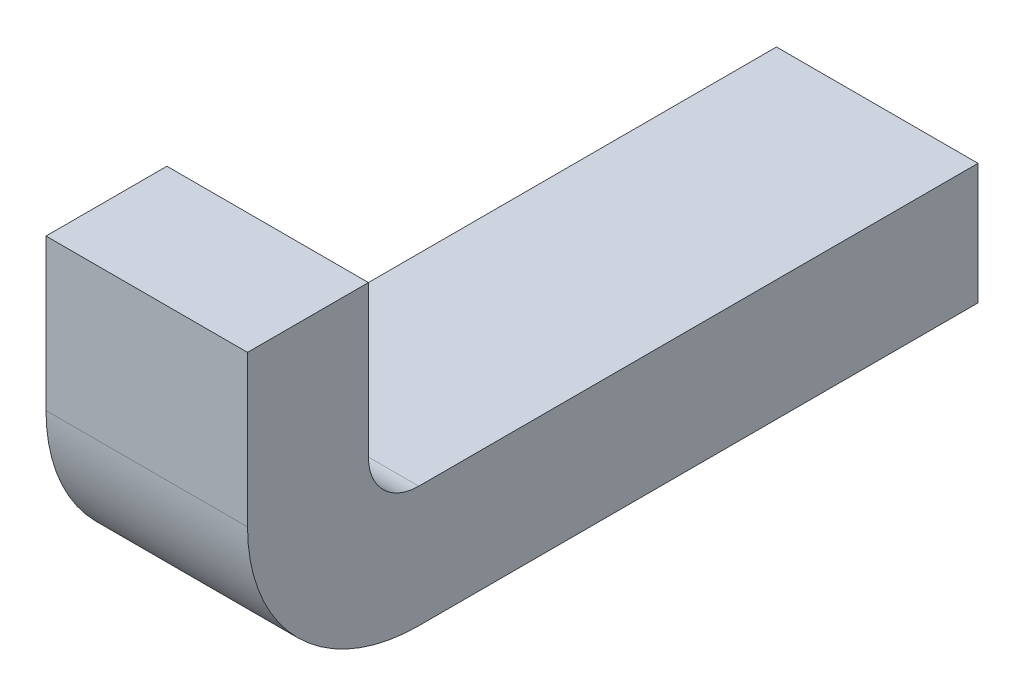
ISO-10303-21;
HEADER;
FILE_DESCRIPTION(('STEP AP214'),'2;1');
FILE_NAME('part.step','',(''),(''),'','','');
FILE_SCHEMA(('AUTOMOTIVE_DESIGN { 1 0 10303 214 1 1 1 1 }'));
ENDSEC;
DATA;
#1=APPLICATION_CONTEXT('core data for automotive mechanical design processes');
#2=APPLICATION_PROTOCOL_DEFINITION('international standard','automotive_design',2000,#1);
#3=PRODUCT_CONTEXT('',#1,'mechanical');
#4=PRODUCT('Part','Part','',(#3));
#5=PRODUCT_RELATED_PRODUCT_CATEGORY('part','',(#4));
#6=PRODUCT_DEFINITION_FORMATION('','',#4);
#7=PRODUCT_DEFINITION_CONTEXT('part definition',#1,'design');
#8=PRODUCT_DEFINITION('design','',#6,#7);
#9=PRODUCT_DEFINITION_SHAPE('','',#8);
#10=(LENGTH_UNIT() NAMED_UNIT(*) SI_UNIT(.MILLI.,.METRE.));
#11=(NAMED_UNIT(*) PLANE_ANGLE_UNIT() SI_UNIT($,.RADIAN.));
#12=(NAMED_UNIT(*) SI_UNIT($,.STERADIAN.) SOLID_ANGLE_UNIT());
#13=UNCERTAINTY_MEASURE_WITH_UNIT(LENGTH_MEASURE(1.E-05),#10,'distance_accuracy_value','');
#14=(GEOMETRIC_REPRESENTATION_CONTEXT(3) GLOBAL_UNCERTAINTY_ASSIGNED_CONTEXT((#13)) GLOBAL_UNIT_ASSIGNED_CONTEXT((#10,
#11,#12)) REPRESENTATION_CONTEXT('',''));
#15=CARTESIAN_POINT('',(0.,0.,0.));
#16=DIRECTION('',(0.,0.,1.));
#17=DIRECTION('',(1.,0.,0.));
#18=AXIS2_PLACEMENT_3D('',#15,#16,#17);
#19=CARTESIAN_POINT('',(2.41,0.17,-3.250000000002));
#20=DIRECTION('',(0.,0.,-1.));
#21=DIRECTION('',(-1.,0.,0.));
#22=AXIS2_PLACEMENT_3D('',#19,#20,#21);
#23=PLANE('',#22);
#24=DIRECTION('',(0.,1.,0.));
#25=VECTOR('',#24,1.);
#26=CARTESIAN_POINT('',(2.625,0.17,-3.250000000002));
#27=LINE('',#26,#25);
#28=CARTESIAN_POINT('',(2.625,0.17,-3.250000000002));
#29=VERTEX_POINT('',#28);
#30=CARTESIAN_POINT('',(2.625,0.32,-3.250000000002));
#31=VERTEX_POINT('',#30);
#32=EDGE_CURVE('E138',#29,#31,#27,.T.);
#33=ORIENTED_EDGE('',*,*,#32,.F.);
#34=DIRECTION('',(1.,0.,0.));
#35=VECTOR('',#34,1.);
#36=CARTESIAN_POINT('',(2.41,0.17,-3.250000000002));
#37=LINE('',#36,#35);
#38=CARTESIAN_POINT('',(2.425,0.17,-3.250000000002));
#39=VERTEX_POINT('',#38);
#40=EDGE_CURVE('E107',#29,#39,#37,.F.);
#41=ORIENTED_EDGE('',*,*,#40,.T.);
#42=DIRECTION('',(0.,1.,0.));
#43=VECTOR('',#42,1.);
#44=CARTESIAN_POINT('',(2.425,0.,-3.250000000002));
#45=LINE('',#44,#43);
#46=CARTESIAN_POINT('',(2.425,0.32,-3.250000000002));
#47=VERTEX_POINT('',#46);
#48=EDGE_CURVE('E104',#39,#47,#45,.T.);
#49=ORIENTED_EDGE('',*,*,#48,.T.);
#50=DIRECTION('',(1.,0.,0.));
#51=VECTOR('',#50,1.);
#52=CARTESIAN_POINT('',(2.41,0.32,-3.250000000002));
#53=LINE('',#52,#51);
#54=EDGE_CURVE('E131',#31,#47,#53,.F.);
#55=ORIENTED_EDGE('',*,*,#54,.F.);
#56=EDGE_LOOP('',(#33,#41,#49,#55));
#57=FACE_BOUND('',#56,.T.);
#58=ADVANCED_FACE('F16',(#57),#23,.T.);
#59=CARTESIAN_POINT('',(2.41,0.32,-3.250000000002));
#60=DIRECTION('',(0.,1.,1.246832498358E-13));
#61=DIRECTION('',(0.,-1.246832498358E-13,1.));
#62=AXIS2_PLACEMENT_3D('',#59,#60,#61);
#63=PLANE('',#62);
#64=DIRECTION('',(0.,0.,-1.));
#65=VECTOR('',#64,1.);
#66=CARTESIAN_POINT('',(2.625,0.32,-3.300000000002));
#67=LINE('',#66,#65);
#68=CARTESIAN_POINT('',(2.625,0.32,-3.130000000002));
#69=VERTEX_POINT('',#68);
#70=EDGE_CURVE('E134',#31,#69,#67,.F.);
#71=ORIENTED_EDGE('',*,*,#70,.F.);
#72=ORIENTED_EDGE('',*,*,#54,.T.);
#73=DIRECTION('',(0.,0.,1.));
#74=VECTOR('',#73,1.);
#75=CARTESIAN_POINT('',(2.425,0.32,3.855));
#76=LINE('',#75,#74);
#77=CARTESIAN_POINT('',(2.425,0.32,-3.130000000002));
#78=VERTEX_POINT('',#77);
#79=EDGE_CURVE('E98',#47,#78,#76,.T.);
#80=ORIENTED_EDGE('',*,*,#79,.T.);
#81=DIRECTION('',(1.,0.,0.));
#82=VECTOR('',#81,1.);
#83=CARTESIAN_POINT('',(2.41,0.32,-3.130000000002));
#84=LINE('',#83,#82);
#85=EDGE_CURVE('E129',#69,#78,#84,.F.);
#86=ORIENTED_EDGE('',*,*,#85,.F.);
#87=EDGE_LOOP('',(#71,#72,#80,#86));
#88=FACE_BOUND('',#87,.T.);
#89=ADVANCED_FACE('F188',(#88),#63,.T.);
#90=CARTESIAN_POINT('',(2.41,0.32,-3.130000000002));
#91=DIRECTION('',(0.,0.,1.));
#92=DIRECTION('',(1.,0.,0.));
#93=AXIS2_PLACEMENT_3D('',#90,#91,#92);
#94=PLANE('',#93);
#95=DIRECTION('',(0.,1.,0.));
#96=VECTOR('',#95,1.);
#97=CARTESIAN_POINT('',(2.625,0.17,-3.130000000002));
#98=LINE('',#97,#96);
#99=CARTESIAN_POINT('',(2.625,0.17,-3.130000000002));
#100=VERTEX_POINT('',#99);
#101=EDGE_CURVE('E137',#69,#100,#98,.F.);
#102=ORIENTED_EDGE('',*,*,#101,.F.);
#103=ORIENTED_EDGE('',*,*,#85,.T.);
#104=DIRECTION('',(0.,1.,0.));
#105=VECTOR('',#104,1.);
#106=CARTESIAN_POINT('',(2.425,0.,-3.130000000002));
#107=LINE('',#106,#105);
#108=CARTESIAN_POINT('',(2.425,0.17,-3.130000000002));
#109=VERTEX_POINT('',#108);
#110=EDGE_CURVE('E78',#78,#109,#107,.F.);
#111=ORIENTED_EDGE('',*,*,#110,.T.);
#112=DIRECTION('',(1.,0.,0.));
#113=VECTOR('',#112,1.);
#114=CARTESIAN_POINT('',(2.41,0.17,-3.130000000002));
#115=LINE('',#114,#113);
#116=EDGE_CURVE('E88',#100,#109,#115,.F.);
#117=ORIENTED_EDGE('',*,*,#116,.F.);
#118=EDGE_LOOP('',(#102,#103,#111,#117));
#119=FACE_BOUND('',#118,.T.);
#120=ADVANCED_FACE('F190',(#119),#94,.T.);
#121=CARTESIAN_POINT('',(2.41,0.17,-3.300000000002));
#122=DIRECTION('',(1.,0.,0.));
#123=DIRECTION('',(0.,0.,-1.));
#124=AXIS2_PLACEMENT_3D('',#121,#122,#123);
#125=CYLINDRICAL_SURFACE('',#124,0.17);
#126=CARTESIAN_POINT('',(2.625,0.17,-3.300000000002));
#127=DIRECTION('',(1.,0.,0.));
#128=DIRECTION('',(0.,0.,-1.));
#129=AXIS2_PLACEMENT_3D('',#126,#127,#128);
#130=CIRCLE('',#129,0.17);
#131=CARTESIAN_POINT('',(2.625,0.,-3.300000000002));
#132=VERTEX_POINT('',#131);
#133=EDGE_CURVE('E149',#100,#132,#130,.T.);
#134=ORIENTED_EDGE('',*,*,#133,.F.);
#135=ORIENTED_EDGE('',*,*,#116,.T.);
#136=CARTESIAN_POINT('',(2.425,0.17,-3.300000000002));
#137=DIRECTION('',(1.,0.,0.));
#138=DIRECTION('',(0.,0.,-1.));
#139=AXIS2_PLACEMENT_3D('',#136,#137,#138);
#140=CIRCLE('',#139,0.17);
#141=CARTESIAN_POINT('',(2.425,0.,-3.300000000002));
#142=VERTEX_POINT('',#141);
#143=EDGE_CURVE('E19',#109,#142,#140,.T.);
#144=ORIENTED_EDGE('',*,*,#143,.T.);
#145=DIRECTION('',(1.,0.,0.));
#146=VECTOR('',#145,1.);
#147=CARTESIAN_POINT('',(2.41,0.,-3.300000000002));
#148=LINE('',#147,#146);
#149=EDGE_CURVE('E86',#132,#142,#148,.F.);
#150=ORIENTED_EDGE('',*,*,#149,.F.);
#151=EDGE_LOOP('',(#134,#135,#144,#150));
#152=FACE_BOUND('',#151,.T.);
#153=ADVANCED_FACE('F85',(#152),#125,.T.);
#154=CARTESIAN_POINT('',(2.41,0.,-3.300000000002));
#155=DIRECTION('',(0.,-1.,0.));
#156=DIRECTION('',(0.,0.,-1.));
#157=AXIS2_PLACEMENT_3D('',#154,#155,#156);
#158=PLANE('',#157);
#159=DIRECTION('',(0.,0.,-1.));
#160=VECTOR('',#159,1.);
#161=CARTESIAN_POINT('',(2.625,0.,-3.300000000002));
#162=LINE('',#161,#160);
#163=CARTESIAN_POINT('',(2.625,0.,-3.854999999999));
#164=VERTEX_POINT('',#163);
#165=EDGE_CURVE('E96',#132,#164,#162,.T.);
#166=ORIENTED_EDGE('',*,*,#165,.F.);
#167=ORIENTED_EDGE('',*,*,#149,.T.);
#168=DIRECTION('',(0.,0.,1.));
#169=VECTOR('',#168,1.);
#170=CARTESIAN_POINT('',(2.425,0.,3.855));
#171=LINE('',#170,#169);
#172=CARTESIAN_POINT('',(2.425,0.,-3.854999999999));
#173=VERTEX_POINT('',#172);
#174=EDGE_CURVE('E91',#142,#173,#171,.F.);
#175=ORIENTED_EDGE('',*,*,#174,.T.);
#176=DIRECTION('',(-1.,0.,0.));
#177=VECTOR('',#176,1.);
#178=CARTESIAN_POINT('',(2.41,0.,-3.854999999999));
#179=LINE('',#178,#177);
#180=EDGE_CURVE('E121',#164,#173,#179,.T.);
#181=ORIENTED_EDGE('',*,*,#180,.F.);
#182=EDGE_LOOP('',(#166,#167,#175,#181));
#183=FACE_BOUND('',#182,.T.);
#184=ADVANCED_FACE('F93',(#183),#158,.T.);
#185=CARTESIAN_POINT('',(2.425,0.,3.855));
#186=DIRECTION('',(1.,0.,0.));
#187=DIRECTION('',(0.,1.,0.));
#188=AXIS2_PLACEMENT_3D('',#185,#186,#187);
#189=PLANE('',#188);
#190=CARTESIAN_POINT('',(2.425,0.17,-3.300000000002));
#191=DIRECTION('',(1.,0.,0.));
#192=DIRECTION('',(0.,0.,-1.));
#193=AXIS2_PLACEMENT_3D('',#190,#191,#192);
#194=CIRCLE('',#193,0.05);
#195=CARTESIAN_POINT('',(2.425,0.12,-3.300000000002));
#196=VERTEX_POINT('',#195);
#197=EDGE_CURVE('E126',#39,#196,#194,.T.);
#198=ORIENTED_EDGE('',*,*,#197,.T.);
#199=DIRECTION('',(0.,0.,1.));
#200=VECTOR('',#199,1.);
#201=CARTESIAN_POINT('',(2.425,0.12,-3.854999999999));
#202=LINE('',#201,#200);
#203=CARTESIAN_POINT('',(2.425,0.12,-3.854999999999));
#204=VERTEX_POINT('',#203);
#205=EDGE_CURVE('E123',#204,#196,#202,.T.);
#206=ORIENTED_EDGE('',*,*,#205,.F.);
#207=DIRECTION('',(0.,1.,0.));
#208=VECTOR('',#207,1.);
#209=CARTESIAN_POINT('',(2.425,0.,-3.854999999999));
#210=LINE('',#209,#208);
#211=EDGE_CURVE('E102',#173,#204,#210,.T.);
#212=ORIENTED_EDGE('',*,*,#211,.F.);
#213=ORIENTED_EDGE('',*,*,#174,.F.);
#214=ORIENTED_EDGE('',*,*,#143,.F.);
#215=ORIENTED_EDGE('',*,*,#110,.F.);
#216=ORIENTED_EDGE('',*,*,#79,.F.);
#217=ORIENTED_EDGE('',*,*,#48,.F.);
#218=EDGE_LOOP('',(#198,#206,#212,#213,#214,#215,#216,#217));
#219=FACE_BOUND('',#218,.T.);
#220=ADVANCED_FACE('F100',(#219),#189,.F.);
#221=CARTESIAN_POINT('',(2.41,0.17,-3.300000000002));
#222=DIRECTION('',(1.,0.,0.));
#223=DIRECTION('',(0.,0.,-1.));
#224=AXIS2_PLACEMENT_3D('',#221,#222,#223);
#225=CYLINDRICAL_SURFACE('',#224,0.05);
#226=ORIENTED_EDGE('',*,*,#40,.F.);
#227=CARTESIAN_POINT('',(2.625,0.17,-3.300000000002));
#228=DIRECTION('',(1.,0.,0.));
#229=DIRECTION('',(0.,0.,-1.));
#230=AXIS2_PLACEMENT_3D('',#227,#228,#229);
#231=CIRCLE('',#230,0.05);
#232=CARTESIAN_POINT('',(2.625,0.12,-3.300000000002));
#233=VERTEX_POINT('',#232);
#234=EDGE_CURVE('E118',#233,#29,#231,.F.);
#235=ORIENTED_EDGE('',*,*,#234,.F.);
#236=DIRECTION('',(1.,0.,0.));
#237=VECTOR('',#236,1.);
#238=CARTESIAN_POINT('',(2.41,0.12,-3.300000000002));
#239=LINE('',#238,#237);
#240=EDGE_CURVE('E161',#196,#233,#239,.T.);
#241=ORIENTED_EDGE('',*,*,#240,.F.);
#242=ORIENTED_EDGE('',*,*,#197,.F.);
#243=EDGE_LOOP('',(#226,#235,#241,#242));
#244=FACE_BOUND('',#243,.T.);
#245=ADVANCED_FACE('F183',(#244),#225,.F.);
#246=CARTESIAN_POINT('',(2.625,0.17,-3.300000000002));
#247=DIRECTION('',(1.,0.,0.));
#248=DIRECTION('',(0.,0.,-1.));
#249=AXIS2_PLACEMENT_3D('',#246,#247,#248);
#250=PLANE('',#249);
#251=DIRECTION('',(0.,0.,1.));
#252=VECTOR('',#251,1.);
#253=CARTESIAN_POINT('',(2.625,0.12,-3.854999999999));
#254=LINE('',#253,#252);
#255=CARTESIAN_POINT('',(2.625,0.12,-3.854999999999));
#256=VERTEX_POINT('',#255);
#257=EDGE_CURVE('E25',#233,#256,#254,.F.);
#258=ORIENTED_EDGE('',*,*,#257,.F.);
#259=ORIENTED_EDGE('',*,*,#234,.T.);
#260=ORIENTED_EDGE('',*,*,#32,.T.);
#261=ORIENTED_EDGE('',*,*,#70,.T.);
#262=ORIENTED_EDGE('',*,*,#101,.T.);
#263=ORIENTED_EDGE('',*,*,#133,.T.);
#264=ORIENTED_EDGE('',*,*,#165,.T.);
#265=DIRECTION('',(0.,1.,0.));
#266=VECTOR('',#265,1.);
#267=CARTESIAN_POINT('',(2.625,0.,-3.854999999999));
#268=LINE('',#267,#266);
#269=EDGE_CURVE('E34',#256,#164,#268,.F.);
#270=ORIENTED_EDGE('',*,*,#269,.F.);
#271=EDGE_LOOP('',(#258,#259,#260,#261,#262,#263,#264,#270));
#272=FACE_BOUND('',#271,.T.);
#273=ADVANCED_FACE('F180',(#272),#250,.T.);
#274=CARTESIAN_POINT('',(2.41,0.,-3.854999999999));
#275=DIRECTION('',(0.,0.,-1.));
#276=DIRECTION('',(-1.,0.,0.));
#277=AXIS2_PLACEMENT_3D('',#274,#275,#276);
#278=PLANE('',#277);
#279=ORIENTED_EDGE('',*,*,#269,.T.);
#280=ORIENTED_EDGE('',*,*,#180,.T.);
#281=ORIENTED_EDGE('',*,*,#211,.T.);
#282=DIRECTION('',(1.,0.,0.));
#283=VECTOR('',#282,1.);
#284=CARTESIAN_POINT('',(2.41,0.12,-3.854999999999));
#285=LINE('',#284,#283);
#286=EDGE_CURVE('E11',#256,#204,#285,.F.);
#287=ORIENTED_EDGE('',*,*,#286,.F.);
#288=EDGE_LOOP('',(#279,#280,#281,#287));
#289=FACE_BOUND('',#288,.T.);
#290=ADVANCED_FACE('F179',(#289),#278,.T.);
#291=CARTESIAN_POINT('',(2.41,0.12,-3.854999999999));
#292=DIRECTION('',(0.,1.,0.));
#293=DIRECTION('',(0.,0.,1.));
#294=AXIS2_PLACEMENT_3D('',#291,#292,#293);
#295=PLANE('',#294);
#296=ORIENTED_EDGE('',*,*,#257,.T.);
#297=ORIENTED_EDGE('',*,*,#286,.T.);
#298=ORIENTED_EDGE('',*,*,#205,.T.);
#299=ORIENTED_EDGE('',*,*,#240,.T.);
#300=EDGE_LOOP('',(#296,#297,#298,#299));
#301=FACE_BOUND('',#300,.T.);
#302=ADVANCED_FACE('F177',(#301),#295,.T.);
#303=CLOSED_SHELL('',(#58,#89,#120,#153,#184,#220,#245,#273,#290,#302));
#304=MANIFOLD_SOLID_BREP('B1',#303);
#305=ADVANCED_BREP_SHAPE_REPRESENTATION('',(#18,#304),#14);
#306=SHAPE_DEFINITION_REPRESENTATION(#9,#305);
ENDSEC;
END-ISO-10303-21;
